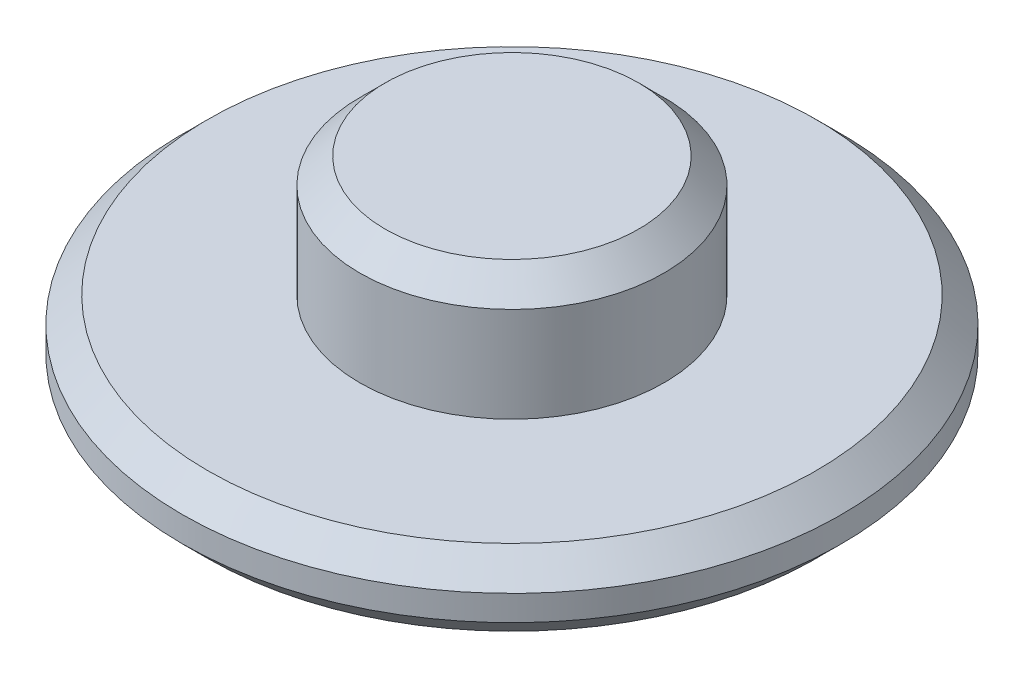
ISO-10303-21;
HEADER;
FILE_DESCRIPTION(('STEP AP214'),'2;1');
FILE_NAME('part.step','',(''),(''),'','','');
FILE_SCHEMA(('AUTOMOTIVE_DESIGN { 1 0 10303 214 1 1 1 1 }'));
ENDSEC;
DATA;
#1=APPLICATION_CONTEXT('core data for automotive mechanical design processes');
#2=APPLICATION_PROTOCOL_DEFINITION('international standard','automotive_design',2000,#1);
#3=PRODUCT_CONTEXT('',#1,'mechanical');
#4=PRODUCT('Part','Part','',(#3));
#5=PRODUCT_RELATED_PRODUCT_CATEGORY('part','',(#4));
#6=PRODUCT_DEFINITION_FORMATION('','',#4);
#7=PRODUCT_DEFINITION_CONTEXT('part definition',#1,'design');
#8=PRODUCT_DEFINITION('design','',#6,#7);
#9=PRODUCT_DEFINITION_SHAPE('','',#8);
#10=(LENGTH_UNIT() NAMED_UNIT(*) SI_UNIT(.MILLI.,.METRE.));
#11=(NAMED_UNIT(*) PLANE_ANGLE_UNIT() SI_UNIT($,.RADIAN.));
#12=(NAMED_UNIT(*) SI_UNIT($,.STERADIAN.) SOLID_ANGLE_UNIT());
#13=UNCERTAINTY_MEASURE_WITH_UNIT(LENGTH_MEASURE(1.E-05),#10,'distance_accuracy_value','');
#14=(GEOMETRIC_REPRESENTATION_CONTEXT(3) GLOBAL_UNCERTAINTY_ASSIGNED_CONTEXT((#13)) GLOBAL_UNIT_ASSIGNED_CONTEXT((#10,
#11,#12)) REPRESENTATION_CONTEXT('',''));
#15=CARTESIAN_POINT('',(0.,0.,0.));
#16=DIRECTION('',(0.,0.,1.));
#17=DIRECTION('',(1.,0.,0.));
#18=AXIS2_PLACEMENT_3D('',#15,#16,#17);
#19=CARTESIAN_POINT('',(0.,4.75,0.));
#20=DIRECTION('',(0.,-1.,0.));
#21=DIRECTION('',(0.,0.,-1.));
#22=AXIS2_PLACEMENT_3D('',#19,#20,#21);
#23=CYLINDRICAL_SURFACE('',#22,6.);
#24=CARTESIAN_POINT('',(0.,3.74999999999999,0.));
#25=DIRECTION('',(0.,1.,0.));
#26=DIRECTION('',(0.,0.,1.));
#27=AXIS2_PLACEMENT_3D('',#24,#25,#26);
#28=CIRCLE('',#27,6.);
#29=CARTESIAN_POINT('',(0.,3.74999999999999,6.));
#30=VERTEX_POINT('',#29);
#31=EDGE_CURVE('E10',#30,#30,#28,.F.);
#32=ORIENTED_EDGE('',*,*,#31,.T.);
#33=EDGE_LOOP('',(#32));
#34=FACE_BOUND('',#33,.T.);
#35=CARTESIAN_POINT('',(0.,0.,0.));
#36=DIRECTION('',(0.,1.,0.));
#37=DIRECTION('',(0.,0.,1.));
#38=AXIS2_PLACEMENT_3D('',#35,#36,#37);
#39=CIRCLE('',#38,6.);
#40=CARTESIAN_POINT('',(0.,0.,6.));
#41=VERTEX_POINT('',#40);
#42=EDGE_CURVE('E60',#41,#41,#39,.T.);
#43=ORIENTED_EDGE('',*,*,#42,.T.);
#44=EDGE_LOOP('',(#43));
#45=FACE_BOUND('',#44,.T.);
#46=ADVANCED_FACE('F34',(#34,#45),#23,.T.);
#47=CARTESIAN_POINT('',(0.,4.75,0.));
#48=DIRECTION('',(0.,1.,0.));
#49=DIRECTION('',(0.,0.,1.));
#50=AXIS2_PLACEMENT_3D('',#47,#48,#49);
#51=PLANE('',#50);
#52=CARTESIAN_POINT('',(0.,4.75,0.));
#53=DIRECTION('',(0.,1.,0.));
#54=DIRECTION('',(0.,0.,1.));
#55=AXIS2_PLACEMENT_3D('',#52,#53,#54);
#56=CIRCLE('',#55,5.);
#57=CARTESIAN_POINT('',(0.,4.75,5.));
#58=VERTEX_POINT('',#57);
#59=EDGE_CURVE('E41',#58,#58,#56,.T.);
#60=ORIENTED_EDGE('',*,*,#59,.T.);
#61=EDGE_LOOP('',(#60));
#62=FACE_BOUND('',#61,.T.);
#63=ADVANCED_FACE('F83',(#62),#51,.T.);
#64=CARTESIAN_POINT('',(0.,-3.,0.));
#65=DIRECTION('',(0.,1.,0.));
#66=DIRECTION('',(0.,0.,1.));
#67=AXIS2_PLACEMENT_3D('',#64,#65,#66);
#68=CYLINDRICAL_SURFACE('',#67,13.);
#69=CARTESIAN_POINT('',(0.,-2.,0.));
#70=DIRECTION('',(0.,1.,0.));
#71=DIRECTION('',(0.,0.,1.));
#72=AXIS2_PLACEMENT_3D('',#69,#70,#71);
#73=CIRCLE('',#72,13.);
#74=CARTESIAN_POINT('',(0.,-2.,13.));
#75=VERTEX_POINT('',#74);
#76=EDGE_CURVE('E54',#75,#75,#73,.T.);
#77=ORIENTED_EDGE('',*,*,#76,.T.);
#78=EDGE_LOOP('',(#77));
#79=FACE_BOUND('',#78,.T.);
#80=CARTESIAN_POINT('',(0.,-1.00000000000001,0.));
#81=DIRECTION('',(0.,1.,0.));
#82=DIRECTION('',(0.,0.,1.));
#83=AXIS2_PLACEMENT_3D('',#80,#81,#82);
#84=CIRCLE('',#83,13.);
#85=CARTESIAN_POINT('',(0.,-1.00000000000001,13.));
#86=VERTEX_POINT('',#85);
#87=EDGE_CURVE('E57',#86,#86,#84,.F.);
#88=ORIENTED_EDGE('',*,*,#87,.T.);
#89=EDGE_LOOP('',(#88));
#90=FACE_BOUND('',#89,.T.);
#91=ADVANCED_FACE('F78',(#79,#90),#68,.T.);
#92=CARTESIAN_POINT('',(0.,-3.,0.));
#93=DIRECTION('',(0.,1.,0.));
#94=DIRECTION('',(0.,0.,1.));
#95=AXIS2_PLACEMENT_3D('',#92,#93,#94);
#96=PLANE('',#95);
#97=CARTESIAN_POINT('',(0.,-3.,0.));
#98=DIRECTION('',(0.,1.,0.));
#99=DIRECTION('',(0.,0.,1.));
#100=AXIS2_PLACEMENT_3D('',#97,#98,#99);
#101=CIRCLE('',#100,12.);
#102=CARTESIAN_POINT('',(0.,-3.,12.));
#103=VERTEX_POINT('',#102);
#104=EDGE_CURVE('E49',#103,#103,#101,.F.);
#105=ORIENTED_EDGE('',*,*,#104,.T.);
#106=EDGE_LOOP('',(#105));
#107=FACE_BOUND('',#106,.T.);
#108=ADVANCED_FACE('F68',(#107),#96,.F.);
#109=CARTESIAN_POINT('',(0.,0.,0.));
#110=DIRECTION('',(0.,1.,0.));
#111=DIRECTION('',(0.,0.,1.));
#112=AXIS2_PLACEMENT_3D('',#109,#110,#111);
#113=PLANE('',#112);
#114=CARTESIAN_POINT('',(0.,0.,0.));
#115=DIRECTION('',(0.,1.,0.));
#116=DIRECTION('',(0.,0.,1.));
#117=AXIS2_PLACEMENT_3D('',#114,#115,#116);
#118=CIRCLE('',#117,12.);
#119=CARTESIAN_POINT('',(0.,0.,12.));
#120=VERTEX_POINT('',#119);
#121=EDGE_CURVE('E45',#120,#120,#118,.T.);
#122=ORIENTED_EDGE('',*,*,#121,.T.);
#123=EDGE_LOOP('',(#122));
#124=FACE_BOUND('',#123,.T.);
#125=ORIENTED_EDGE('',*,*,#42,.F.);
#126=EDGE_LOOP('',(#125));
#127=FACE_BOUND('',#126,.T.);
#128=ADVANCED_FACE('F65',(#124,#127),#113,.T.);
#129=CARTESIAN_POINT('',(0.,-2.,0.));
#130=DIRECTION('',(0.,1.,0.));
#131=DIRECTION('',(0.,0.,1.));
#132=AXIS2_PLACEMENT_3D('',#129,#130,#131);
#133=CONICAL_SURFACE('',#132,13.,0.78539816339745);
#134=ORIENTED_EDGE('',*,*,#104,.F.);
#135=EDGE_LOOP('',(#134));
#136=FACE_BOUND('',#135,.T.);
#137=ORIENTED_EDGE('',*,*,#76,.F.);
#138=EDGE_LOOP('',(#137));
#139=FACE_BOUND('',#138,.T.);
#140=ADVANCED_FACE('F67',(#136,#139),#133,.T.);
#141=CARTESIAN_POINT('',(0.,0.,0.));
#142=DIRECTION('',(0.,-1.,0.));
#143=DIRECTION('',(0.,0.,-1.));
#144=AXIS2_PLACEMENT_3D('',#141,#142,#143);
#145=CONICAL_SURFACE('',#144,12.,0.785398163397447);
#146=ORIENTED_EDGE('',*,*,#87,.F.);
#147=EDGE_LOOP('',(#146));
#148=FACE_BOUND('',#147,.T.);
#149=ORIENTED_EDGE('',*,*,#121,.F.);
#150=EDGE_LOOP('',(#149));
#151=FACE_BOUND('',#150,.T.);
#152=ADVANCED_FACE('F75',(#148,#151),#145,.T.);
#153=CARTESIAN_POINT('',(0.,4.75,0.));
#154=DIRECTION('',(0.,-1.,0.));
#155=DIRECTION('',(0.,0.,-1.));
#156=AXIS2_PLACEMENT_3D('',#153,#154,#155);
#157=CONICAL_SURFACE('',#156,5.,0.785398163397445);
#158=ORIENTED_EDGE('',*,*,#31,.F.);
#159=EDGE_LOOP('',(#158));
#160=FACE_BOUND('',#159,.T.);
#161=ORIENTED_EDGE('',*,*,#59,.F.);
#162=EDGE_LOOP('',(#161));
#163=FACE_BOUND('',#162,.T.);
#164=ADVANCED_FACE('F36',(#160,#163),#157,.T.);
#165=CLOSED_SHELL('',(#46,#63,#91,#108,#128,#140,#152,#164));
#166=MANIFOLD_SOLID_BREP('B2',#165);
#167=ADVANCED_BREP_SHAPE_REPRESENTATION('',(#18,#166),#14);
#168=SHAPE_DEFINITION_REPRESENTATION(#9,#167);
ENDSEC;
END-ISO-10303-21;
